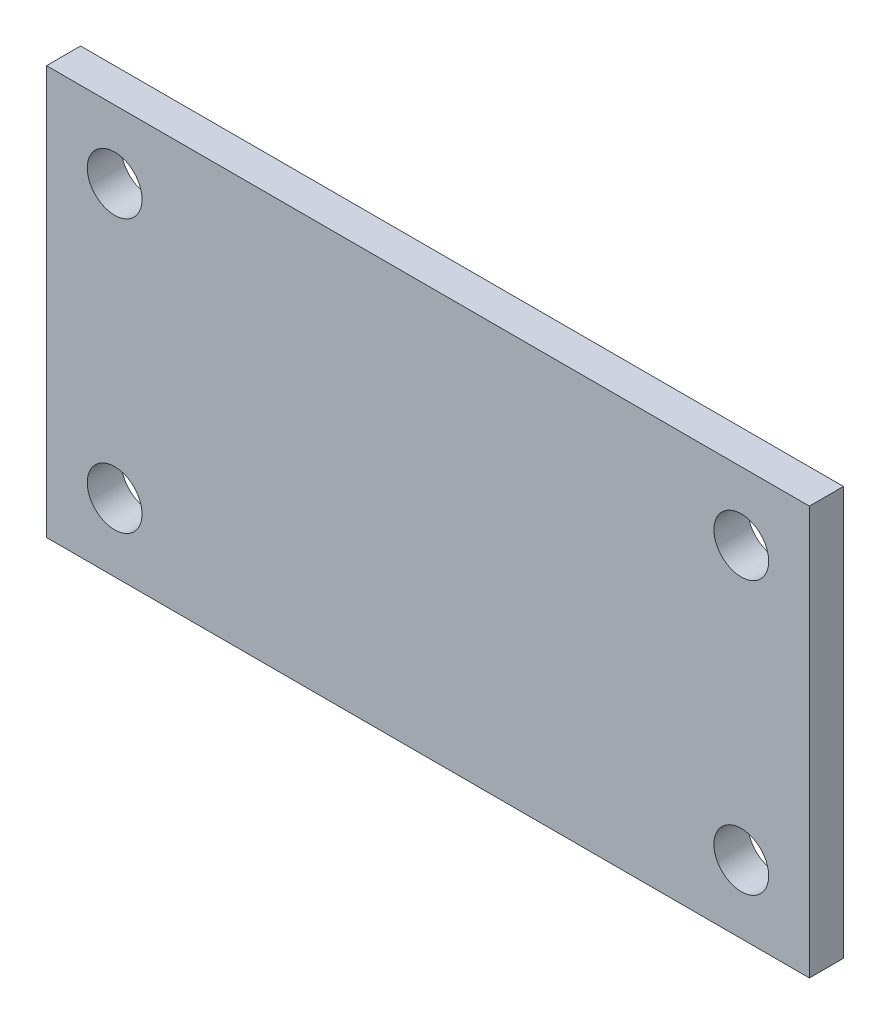
ISO-10303-21;
HEADER;
FILE_DESCRIPTION(('STEP AP214'),'2;1');
FILE_NAME('part.step','',(''),(''),'','','');
FILE_SCHEMA(('AUTOMOTIVE_DESIGN { 1 0 10303 214 1 1 1 1 }'));
ENDSEC;
DATA;
#1=APPLICATION_CONTEXT('core data for automotive mechanical design processes');
#2=APPLICATION_PROTOCOL_DEFINITION('international standard','automotive_design',2000,#1);
#3=PRODUCT_CONTEXT('',#1,'mechanical');
#4=PRODUCT('Part','Part','',(#3));
#5=PRODUCT_RELATED_PRODUCT_CATEGORY('part','',(#4));
#6=PRODUCT_DEFINITION_FORMATION('','',#4);
#7=PRODUCT_DEFINITION_CONTEXT('part definition',#1,'design');
#8=PRODUCT_DEFINITION('design','',#6,#7);
#9=PRODUCT_DEFINITION_SHAPE('','',#8);
#10=(LENGTH_UNIT() NAMED_UNIT(*) SI_UNIT(.MILLI.,.METRE.));
#11=(NAMED_UNIT(*) PLANE_ANGLE_UNIT() SI_UNIT($,.RADIAN.));
#12=(NAMED_UNIT(*) SI_UNIT($,.STERADIAN.) SOLID_ANGLE_UNIT());
#13=UNCERTAINTY_MEASURE_WITH_UNIT(LENGTH_MEASURE(1.E-05),#10,'distance_accuracy_value','');
#14=(GEOMETRIC_REPRESENTATION_CONTEXT(3) GLOBAL_UNCERTAINTY_ASSIGNED_CONTEXT((#13)) GLOBAL_UNIT_ASSIGNED_CONTEXT((#10,
#11,#12)) REPRESENTATION_CONTEXT('',''));
#15=CARTESIAN_POINT('',(0.,0.,0.));
#16=DIRECTION('',(0.,0.,1.));
#17=DIRECTION('',(1.,0.,0.));
#18=AXIS2_PLACEMENT_3D('',#15,#16,#17);
#19=CARTESIAN_POINT('',(0.,0.,3.175));
#20=DIRECTION('',(1.,0.,0.));
#21=DIRECTION('',(0.,0.,-1.));
#22=AXIS2_PLACEMENT_3D('',#19,#20,#21);
#23=PLANE('',#22);
#24=DIRECTION('',(0.,-1.,0.));
#25=VECTOR('',#24,1.);
#26=CARTESIAN_POINT('',(0.,0.,0.));
#27=LINE('',#26,#25);
#28=CARTESIAN_POINT('',(0.,38.1,0.));
#29=VERTEX_POINT('',#28);
#30=CARTESIAN_POINT('',(0.,0.,0.));
#31=VERTEX_POINT('',#30);
#32=EDGE_CURVE('E101',#29,#31,#27,.T.);
#33=ORIENTED_EDGE('',*,*,#32,.T.);
#34=DIRECTION('',(0.,0.,-1.));
#35=VECTOR('',#34,1.);
#36=CARTESIAN_POINT('',(0.,0.,3.175));
#37=LINE('',#36,#35);
#38=CARTESIAN_POINT('',(0.,0.,3.175));
#39=VERTEX_POINT('',#38);
#40=EDGE_CURVE('E11',#39,#31,#37,.T.);
#41=ORIENTED_EDGE('',*,*,#40,.F.);
#42=DIRECTION('',(0.,-1.,0.));
#43=VECTOR('',#42,1.);
#44=CARTESIAN_POINT('',(0.,0.,3.175));
#45=LINE('',#44,#43);
#46=CARTESIAN_POINT('',(0.,38.1,3.175));
#47=VERTEX_POINT('',#46);
#48=EDGE_CURVE('E89',#47,#39,#45,.T.);
#49=ORIENTED_EDGE('',*,*,#48,.F.);
#50=DIRECTION('',(0.,0.,-1.));
#51=VECTOR('',#50,1.);
#52=CARTESIAN_POINT('',(0.,38.1,3.175));
#53=LINE('',#52,#51);
#54=EDGE_CURVE('E97',#47,#29,#53,.T.);
#55=ORIENTED_EDGE('',*,*,#54,.T.);
#56=EDGE_LOOP('',(#33,#41,#49,#55));
#57=FACE_BOUND('',#56,.T.);
#58=ADVANCED_FACE('F38',(#57),#23,.F.);
#59=CARTESIAN_POINT('',(0.,0.,3.175));
#60=DIRECTION('',(0.,1.,0.));
#61=DIRECTION('',(0.,0.,1.));
#62=AXIS2_PLACEMENT_3D('',#59,#60,#61);
#63=PLANE('',#62);
#64=DIRECTION('',(1.,0.,0.));
#65=VECTOR('',#64,1.);
#66=CARTESIAN_POINT('',(0.,0.,0.));
#67=LINE('',#66,#65);
#68=CARTESIAN_POINT('',(71.12,0.,0.));
#69=VERTEX_POINT('',#68);
#70=EDGE_CURVE('E93',#31,#69,#67,.T.);
#71=ORIENTED_EDGE('',*,*,#70,.T.);
#72=DIRECTION('',(0.,0.,-1.));
#73=VECTOR('',#72,1.);
#74=CARTESIAN_POINT('',(71.12,0.,3.175));
#75=LINE('',#74,#73);
#76=CARTESIAN_POINT('',(71.12,0.,3.175));
#77=VERTEX_POINT('',#76);
#78=EDGE_CURVE('E46',#77,#69,#75,.T.);
#79=ORIENTED_EDGE('',*,*,#78,.F.);
#80=DIRECTION('',(1.,0.,0.));
#81=VECTOR('',#80,1.);
#82=CARTESIAN_POINT('',(0.,0.,3.175));
#83=LINE('',#82,#81);
#84=EDGE_CURVE('E84',#39,#77,#83,.T.);
#85=ORIENTED_EDGE('',*,*,#84,.F.);
#86=ORIENTED_EDGE('',*,*,#40,.T.);
#87=EDGE_LOOP('',(#71,#79,#85,#86));
#88=FACE_BOUND('',#87,.T.);
#89=ADVANCED_FACE('F92',(#88),#63,.F.);
#90=CARTESIAN_POINT('',(71.12,0.,3.175));
#91=DIRECTION('',(-1.,0.,0.));
#92=DIRECTION('',(0.,0.,1.));
#93=AXIS2_PLACEMENT_3D('',#90,#91,#92);
#94=PLANE('',#93);
#95=DIRECTION('',(0.,1.,0.));
#96=VECTOR('',#95,1.);
#97=CARTESIAN_POINT('',(71.12,0.,0.));
#98=LINE('',#97,#96);
#99=CARTESIAN_POINT('',(71.12,38.1,0.));
#100=VERTEX_POINT('',#99);
#101=EDGE_CURVE('E71',#69,#100,#98,.T.);
#102=ORIENTED_EDGE('',*,*,#101,.T.);
#103=DIRECTION('',(0.,0.,-1.));
#104=VECTOR('',#103,1.);
#105=CARTESIAN_POINT('',(71.12,38.1,3.175));
#106=LINE('',#105,#104);
#107=CARTESIAN_POINT('',(71.12,38.1,3.175));
#108=VERTEX_POINT('',#107);
#109=EDGE_CURVE('E94',#108,#100,#106,.T.);
#110=ORIENTED_EDGE('',*,*,#109,.F.);
#111=DIRECTION('',(0.,1.,0.));
#112=VECTOR('',#111,1.);
#113=CARTESIAN_POINT('',(71.12,0.,3.175));
#114=LINE('',#113,#112);
#115=EDGE_CURVE('E87',#77,#108,#114,.T.);
#116=ORIENTED_EDGE('',*,*,#115,.F.);
#117=ORIENTED_EDGE('',*,*,#78,.T.);
#118=EDGE_LOOP('',(#102,#110,#116,#117));
#119=FACE_BOUND('',#118,.T.);
#120=ADVANCED_FACE('F95',(#119),#94,.F.);
#121=CARTESIAN_POINT('',(0.,38.1,3.175));
#122=DIRECTION('',(0.,-1.,0.));
#123=DIRECTION('',(0.,0.,-1.));
#124=AXIS2_PLACEMENT_3D('',#121,#122,#123);
#125=PLANE('',#124);
#126=DIRECTION('',(-1.,0.,0.));
#127=VECTOR('',#126,1.);
#128=CARTESIAN_POINT('',(0.,38.1,0.));
#129=LINE('',#128,#127);
#130=EDGE_CURVE('E77',#100,#29,#129,.T.);
#131=ORIENTED_EDGE('',*,*,#130,.T.);
#132=ORIENTED_EDGE('',*,*,#54,.F.);
#133=DIRECTION('',(-1.,0.,0.));
#134=VECTOR('',#133,1.);
#135=CARTESIAN_POINT('',(0.,38.1,3.175));
#136=LINE('',#135,#134);
#137=EDGE_CURVE('E54',#108,#47,#136,.T.);
#138=ORIENTED_EDGE('',*,*,#137,.F.);
#139=ORIENTED_EDGE('',*,*,#109,.T.);
#140=EDGE_LOOP('',(#131,#132,#138,#139));
#141=FACE_BOUND('',#140,.T.);
#142=ADVANCED_FACE('F109',(#141),#125,.F.);
#143=CARTESIAN_POINT('',(0.,0.,3.175));
#144=DIRECTION('',(0.,0.,-1.));
#145=DIRECTION('',(-1.,0.,0.));
#146=AXIS2_PLACEMENT_3D('',#143,#144,#145);
#147=PLANE('',#146);
#148=CARTESIAN_POINT('',(6.35,31.75,3.175));
#149=DIRECTION('',(0.,0.,-1.));
#150=DIRECTION('',(-1.,0.,0.));
#151=AXIS2_PLACEMENT_3D('',#148,#149,#150);
#152=CIRCLE('',#151,2.5527);
#153=CARTESIAN_POINT('',(3.7973,31.75,3.175));
#154=VERTEX_POINT('',#153);
#155=EDGE_CURVE('E121',#154,#154,#152,.F.);
#156=ORIENTED_EDGE('',*,*,#155,.F.);
#157=EDGE_LOOP('',(#156));
#158=FACE_BOUND('',#157,.T.);
#159=CARTESIAN_POINT('',(64.77,31.75,3.175));
#160=DIRECTION('',(0.,0.,-1.));
#161=DIRECTION('',(-1.,0.,0.));
#162=AXIS2_PLACEMENT_3D('',#159,#160,#161);
#163=CIRCLE('',#162,2.55270000000001);
#164=CARTESIAN_POINT('',(62.2173,31.75,3.175));
#165=VERTEX_POINT('',#164);
#166=EDGE_CURVE('E128',#165,#165,#163,.F.);
#167=ORIENTED_EDGE('',*,*,#166,.F.);
#168=EDGE_LOOP('',(#167));
#169=FACE_BOUND('',#168,.T.);
#170=CARTESIAN_POINT('',(64.77,6.35,3.175));
#171=DIRECTION('',(0.,0.,-1.));
#172=DIRECTION('',(-1.,0.,0.));
#173=AXIS2_PLACEMENT_3D('',#170,#171,#172);
#174=CIRCLE('',#173,2.55270000000001);
#175=CARTESIAN_POINT('',(62.2173,6.35,3.175));
#176=VERTEX_POINT('',#175);
#177=EDGE_CURVE('E120',#176,#176,#174,.F.);
#178=ORIENTED_EDGE('',*,*,#177,.F.);
#179=EDGE_LOOP('',(#178));
#180=FACE_BOUND('',#179,.T.);
#181=CARTESIAN_POINT('',(6.35,6.35,3.175));
#182=DIRECTION('',(0.,0.,-1.));
#183=DIRECTION('',(-1.,0.,0.));
#184=AXIS2_PLACEMENT_3D('',#181,#182,#183);
#185=CIRCLE('',#184,2.5527);
#186=CARTESIAN_POINT('',(3.7973,6.35,3.175));
#187=VERTEX_POINT('',#186);
#188=EDGE_CURVE('E104',#187,#187,#185,.F.);
#189=ORIENTED_EDGE('',*,*,#188,.F.);
#190=EDGE_LOOP('',(#189));
#191=FACE_BOUND('',#190,.T.);
#192=ORIENTED_EDGE('',*,*,#48,.T.);
#193=ORIENTED_EDGE('',*,*,#84,.T.);
#194=ORIENTED_EDGE('',*,*,#115,.T.);
#195=ORIENTED_EDGE('',*,*,#137,.T.);
#196=EDGE_LOOP('',(#192,#193,#194,#195));
#197=FACE_BOUND('',#196,.T.);
#198=ADVANCED_FACE('F85',(#158,#169,#180,#191,#197),#147,.F.);
#199=CARTESIAN_POINT('',(0.,0.,0.));
#200=DIRECTION('',(0.,0.,-1.));
#201=DIRECTION('',(-1.,0.,0.));
#202=AXIS2_PLACEMENT_3D('',#199,#200,#201);
#203=PLANE('',#202);
#204=CARTESIAN_POINT('',(6.35,31.75,0.));
#205=DIRECTION('',(0.,0.,-1.));
#206=DIRECTION('',(1.,0.,0.));
#207=AXIS2_PLACEMENT_3D('',#204,#205,#206);
#208=CIRCLE('',#207,2.5527);
#209=CARTESIAN_POINT('',(8.9027,31.75,0.));
#210=VERTEX_POINT('',#209);
#211=EDGE_CURVE('E125',#210,#210,#208,.T.);
#212=ORIENTED_EDGE('',*,*,#211,.F.);
#213=EDGE_LOOP('',(#212));
#214=FACE_BOUND('',#213,.T.);
#215=CARTESIAN_POINT('',(64.77,31.75,0.));
#216=DIRECTION('',(0.,0.,-1.));
#217=DIRECTION('',(-1.,0.,0.));
#218=AXIS2_PLACEMENT_3D('',#215,#216,#217);
#219=CIRCLE('',#218,2.55270000000001);
#220=CARTESIAN_POINT('',(62.2173,31.75,0.));
#221=VERTEX_POINT('',#220);
#222=EDGE_CURVE('E124',#221,#221,#219,.T.);
#223=ORIENTED_EDGE('',*,*,#222,.F.);
#224=EDGE_LOOP('',(#223));
#225=FACE_BOUND('',#224,.T.);
#226=CARTESIAN_POINT('',(64.77,6.35,0.));
#227=DIRECTION('',(0.,0.,-1.));
#228=DIRECTION('',(1.,0.,0.));
#229=AXIS2_PLACEMENT_3D('',#226,#227,#228);
#230=CIRCLE('',#229,2.55270000000001);
#231=CARTESIAN_POINT('',(67.3227,6.35,0.));
#232=VERTEX_POINT('',#231);
#233=EDGE_CURVE('E131',#232,#232,#230,.T.);
#234=ORIENTED_EDGE('',*,*,#233,.F.);
#235=EDGE_LOOP('',(#234));
#236=FACE_BOUND('',#235,.T.);
#237=CARTESIAN_POINT('',(6.35,6.35,0.));
#238=DIRECTION('',(0.,0.,-1.));
#239=DIRECTION('',(-1.,0.,0.));
#240=AXIS2_PLACEMENT_3D('',#237,#238,#239);
#241=CIRCLE('',#240,2.5527);
#242=CARTESIAN_POINT('',(3.7973,6.35,0.));
#243=VERTEX_POINT('',#242);
#244=EDGE_CURVE('E117',#243,#243,#241,.T.);
#245=ORIENTED_EDGE('',*,*,#244,.F.);
#246=EDGE_LOOP('',(#245));
#247=FACE_BOUND('',#246,.T.);
#248=ORIENTED_EDGE('',*,*,#32,.F.);
#249=ORIENTED_EDGE('',*,*,#130,.F.);
#250=ORIENTED_EDGE('',*,*,#101,.F.);
#251=ORIENTED_EDGE('',*,*,#70,.F.);
#252=EDGE_LOOP('',(#248,#249,#250,#251));
#253=FACE_BOUND('',#252,.T.);
#254=ADVANCED_FACE('F112',(#214,#225,#236,#247,#253),#203,.T.);
#255=CARTESIAN_POINT('',(6.35,6.35,3.176));
#256=DIRECTION('',(0.,0.,-1.));
#257=DIRECTION('',(-1.,0.,0.));
#258=AXIS2_PLACEMENT_3D('',#255,#256,#257);
#259=CYLINDRICAL_SURFACE('',#258,2.5527);
#260=ORIENTED_EDGE('',*,*,#244,.T.);
#261=EDGE_LOOP('',(#260));
#262=FACE_BOUND('',#261,.T.);
#263=ORIENTED_EDGE('',*,*,#188,.T.);
#264=EDGE_LOOP('',(#263));
#265=FACE_BOUND('',#264,.T.);
#266=ADVANCED_FACE('F144',(#262,#265),#259,.F.);
#267=CARTESIAN_POINT('',(64.77,6.35,3.176));
#268=DIRECTION('',(0.,0.,-1.));
#269=DIRECTION('',(-1.,0.,0.));
#270=AXIS2_PLACEMENT_3D('',#267,#268,#269);
#271=CYLINDRICAL_SURFACE('',#270,2.55270000000001);
#272=ORIENTED_EDGE('',*,*,#233,.T.);
#273=EDGE_LOOP('',(#272));
#274=FACE_BOUND('',#273,.T.);
#275=ORIENTED_EDGE('',*,*,#177,.T.);
#276=EDGE_LOOP('',(#275));
#277=FACE_BOUND('',#276,.T.);
#278=ADVANCED_FACE('F139',(#274,#277),#271,.F.);
#279=CARTESIAN_POINT('',(64.77,31.75,3.176));
#280=DIRECTION('',(0.,0.,-1.));
#281=DIRECTION('',(-1.,0.,0.));
#282=AXIS2_PLACEMENT_3D('',#279,#280,#281);
#283=CYLINDRICAL_SURFACE('',#282,2.55270000000001);
#284=ORIENTED_EDGE('',*,*,#222,.T.);
#285=EDGE_LOOP('',(#284));
#286=FACE_BOUND('',#285,.T.);
#287=ORIENTED_EDGE('',*,*,#166,.T.);
#288=EDGE_LOOP('',(#287));
#289=FACE_BOUND('',#288,.T.);
#290=ADVANCED_FACE('F202',(#286,#289),#283,.F.);
#291=CARTESIAN_POINT('',(6.35,31.75,3.176));
#292=DIRECTION('',(0.,0.,-1.));
#293=DIRECTION('',(-1.,0.,0.));
#294=AXIS2_PLACEMENT_3D('',#291,#292,#293);
#295=CYLINDRICAL_SURFACE('',#294,2.5527);
#296=ORIENTED_EDGE('',*,*,#211,.T.);
#297=EDGE_LOOP('',(#296));
#298=FACE_BOUND('',#297,.T.);
#299=ORIENTED_EDGE('',*,*,#155,.T.);
#300=EDGE_LOOP('',(#299));
#301=FACE_BOUND('',#300,.T.);
#302=ADVANCED_FACE('F211',(#298,#301),#295,.F.);
#303=CLOSED_SHELL('',(#58,#89,#120,#142,#198,#254,#266,#278,#290,#302));
#304=MANIFOLD_SOLID_BREP('B2',#303);
#305=ADVANCED_BREP_SHAPE_REPRESENTATION('',(#18,#304),#14);
#306=SHAPE_DEFINITION_REPRESENTATION(#9,#305);
ENDSEC;
END-ISO-10303-21;
